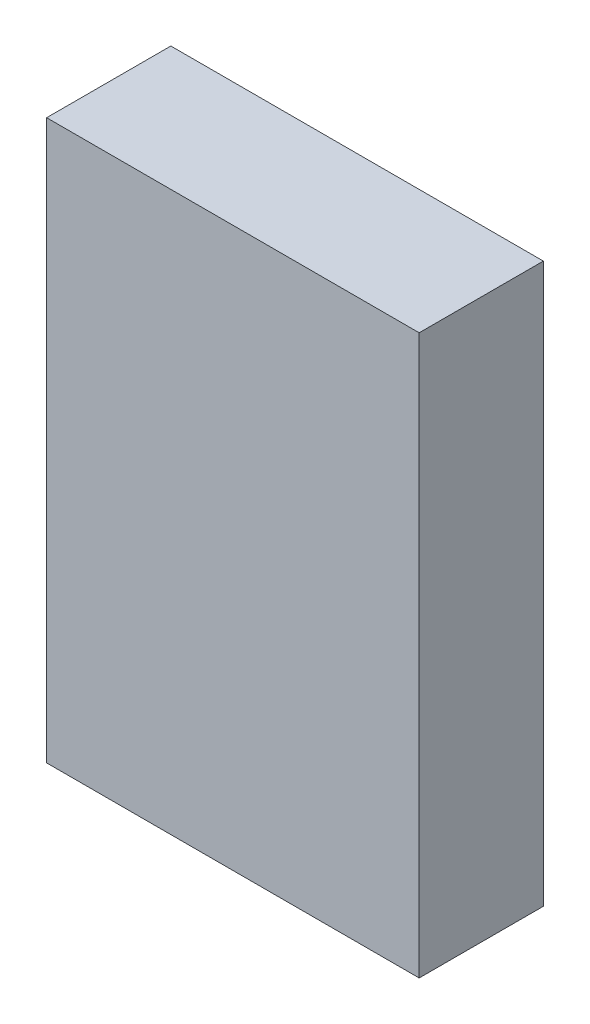
ISO-10303-21;
HEADER;
FILE_DESCRIPTION(('STEP AP214'),'2;1');
FILE_NAME('part.step','',(''),(''),'','','');
FILE_SCHEMA(('AUTOMOTIVE_DESIGN { 1 0 10303 214 1 1 1 1 }'));
ENDSEC;
DATA;
#1=APPLICATION_CONTEXT('core data for automotive mechanical design processes');
#2=APPLICATION_PROTOCOL_DEFINITION('international standard','automotive_design',2000,#1);
#3=PRODUCT_CONTEXT('',#1,'mechanical');
#4=PRODUCT('Part','Part','',(#3));
#5=PRODUCT_RELATED_PRODUCT_CATEGORY('part','',(#4));
#6=PRODUCT_DEFINITION_FORMATION('','',#4);
#7=PRODUCT_DEFINITION_CONTEXT('part definition',#1,'design');
#8=PRODUCT_DEFINITION('design','',#6,#7);
#9=PRODUCT_DEFINITION_SHAPE('','',#8);
#10=(LENGTH_UNIT() NAMED_UNIT(*) SI_UNIT(.MILLI.,.METRE.));
#11=(NAMED_UNIT(*) PLANE_ANGLE_UNIT() SI_UNIT($,.RADIAN.));
#12=(NAMED_UNIT(*) SI_UNIT($,.STERADIAN.) SOLID_ANGLE_UNIT());
#13=UNCERTAINTY_MEASURE_WITH_UNIT(LENGTH_MEASURE(1.E-05),#10,'distance_accuracy_value','');
#14=(GEOMETRIC_REPRESENTATION_CONTEXT(3) GLOBAL_UNCERTAINTY_ASSIGNED_CONTEXT((#13)) GLOBAL_UNIT_ASSIGNED_CONTEXT((#10,
#11,#12)) REPRESENTATION_CONTEXT('',''));
#15=CARTESIAN_POINT('',(0.,0.,0.));
#16=DIRECTION('',(0.,0.,1.));
#17=DIRECTION('',(1.,0.,0.));
#18=AXIS2_PLACEMENT_3D('',#15,#16,#17);
#19=CARTESIAN_POINT('',(0.,0.,20.));
#20=DIRECTION('',(1.,0.,0.));
#21=DIRECTION('',(0.,0.,-1.));
#22=AXIS2_PLACEMENT_3D('',#19,#20,#21);
#23=PLANE('',#22);
#24=DIRECTION('',(0.,-1.,0.));
#25=VECTOR('',#24,1.);
#26=CARTESIAN_POINT('',(0.,0.,0.));
#27=LINE('',#26,#25);
#28=CARTESIAN_POINT('',(0.,90.,0.));
#29=VERTEX_POINT('',#28);
#30=CARTESIAN_POINT('',(0.,0.,0.));
#31=VERTEX_POINT('',#30);
#32=EDGE_CURVE('E96',#29,#31,#27,.T.);
#33=ORIENTED_EDGE('',*,*,#32,.T.);
#34=DIRECTION('',(0.,0.,-1.));
#35=VECTOR('',#34,1.);
#36=CARTESIAN_POINT('',(0.,0.,20.));
#37=LINE('',#36,#35);
#38=CARTESIAN_POINT('',(0.,0.,20.));
#39=VERTEX_POINT('',#38);
#40=EDGE_CURVE('E11',#39,#31,#37,.T.);
#41=ORIENTED_EDGE('',*,*,#40,.F.);
#42=DIRECTION('',(0.,-1.,0.));
#43=VECTOR('',#42,1.);
#44=CARTESIAN_POINT('',(0.,0.,20.));
#45=LINE('',#44,#43);
#46=CARTESIAN_POINT('',(0.,90.,20.));
#47=VERTEX_POINT('',#46);
#48=EDGE_CURVE('E84',#47,#39,#45,.T.);
#49=ORIENTED_EDGE('',*,*,#48,.F.);
#50=DIRECTION('',(0.,0.,-1.));
#51=VECTOR('',#50,1.);
#52=CARTESIAN_POINT('',(0.,90.,20.));
#53=LINE('',#52,#51);
#54=EDGE_CURVE('E92',#47,#29,#53,.T.);
#55=ORIENTED_EDGE('',*,*,#54,.T.);
#56=EDGE_LOOP('',(#33,#41,#49,#55));
#57=FACE_BOUND('',#56,.T.);
#58=ADVANCED_FACE('F33',(#57),#23,.F.);
#59=CARTESIAN_POINT('',(0.,0.,20.));
#60=DIRECTION('',(0.,1.,0.));
#61=DIRECTION('',(0.,0.,1.));
#62=AXIS2_PLACEMENT_3D('',#59,#60,#61);
#63=PLANE('',#62);
#64=DIRECTION('',(1.,0.,0.));
#65=VECTOR('',#64,1.);
#66=CARTESIAN_POINT('',(0.,0.,0.));
#67=LINE('',#66,#65);
#68=CARTESIAN_POINT('',(60.,0.,0.));
#69=VERTEX_POINT('',#68);
#70=EDGE_CURVE('E88',#31,#69,#67,.T.);
#71=ORIENTED_EDGE('',*,*,#70,.T.);
#72=DIRECTION('',(0.,0.,-1.));
#73=VECTOR('',#72,1.);
#74=CARTESIAN_POINT('',(60.,0.,20.));
#75=LINE('',#74,#73);
#76=CARTESIAN_POINT('',(60.,0.,20.));
#77=VERTEX_POINT('',#76);
#78=EDGE_CURVE('E41',#77,#69,#75,.T.);
#79=ORIENTED_EDGE('',*,*,#78,.F.);
#80=DIRECTION('',(1.,0.,0.));
#81=VECTOR('',#80,1.);
#82=CARTESIAN_POINT('',(0.,0.,20.));
#83=LINE('',#82,#81);
#84=EDGE_CURVE('E79',#39,#77,#83,.T.);
#85=ORIENTED_EDGE('',*,*,#84,.F.);
#86=ORIENTED_EDGE('',*,*,#40,.T.);
#87=EDGE_LOOP('',(#71,#79,#85,#86));
#88=FACE_BOUND('',#87,.T.);
#89=ADVANCED_FACE('F87',(#88),#63,.F.);
#90=CARTESIAN_POINT('',(60.,0.,20.));
#91=DIRECTION('',(-1.,0.,0.));
#92=DIRECTION('',(0.,0.,1.));
#93=AXIS2_PLACEMENT_3D('',#90,#91,#92);
#94=PLANE('',#93);
#95=DIRECTION('',(0.,1.,0.));
#96=VECTOR('',#95,1.);
#97=CARTESIAN_POINT('',(60.,0.,0.));
#98=LINE('',#97,#96);
#99=CARTESIAN_POINT('',(60.,90.,0.));
#100=VERTEX_POINT('',#99);
#101=EDGE_CURVE('E66',#69,#100,#98,.T.);
#102=ORIENTED_EDGE('',*,*,#101,.T.);
#103=DIRECTION('',(0.,0.,-1.));
#104=VECTOR('',#103,1.);
#105=CARTESIAN_POINT('',(60.,90.,20.));
#106=LINE('',#105,#104);
#107=CARTESIAN_POINT('',(60.,90.,20.));
#108=VERTEX_POINT('',#107);
#109=EDGE_CURVE('E89',#108,#100,#106,.T.);
#110=ORIENTED_EDGE('',*,*,#109,.F.);
#111=DIRECTION('',(0.,1.,0.));
#112=VECTOR('',#111,1.);
#113=CARTESIAN_POINT('',(60.,0.,20.));
#114=LINE('',#113,#112);
#115=EDGE_CURVE('E82',#77,#108,#114,.T.);
#116=ORIENTED_EDGE('',*,*,#115,.F.);
#117=ORIENTED_EDGE('',*,*,#78,.T.);
#118=EDGE_LOOP('',(#102,#110,#116,#117));
#119=FACE_BOUND('',#118,.T.);
#120=ADVANCED_FACE('F90',(#119),#94,.F.);
#121=CARTESIAN_POINT('',(0.,90.,20.));
#122=DIRECTION('',(0.,-1.,0.));
#123=DIRECTION('',(0.,0.,-1.));
#124=AXIS2_PLACEMENT_3D('',#121,#122,#123);
#125=PLANE('',#124);
#126=DIRECTION('',(-1.,0.,0.));
#127=VECTOR('',#126,1.);
#128=CARTESIAN_POINT('',(0.,90.,0.));
#129=LINE('',#128,#127);
#130=EDGE_CURVE('E72',#100,#29,#129,.T.);
#131=ORIENTED_EDGE('',*,*,#130,.T.);
#132=ORIENTED_EDGE('',*,*,#54,.F.);
#133=DIRECTION('',(-1.,0.,0.));
#134=VECTOR('',#133,1.);
#135=CARTESIAN_POINT('',(0.,90.,20.));
#136=LINE('',#135,#134);
#137=EDGE_CURVE('E49',#108,#47,#136,.T.);
#138=ORIENTED_EDGE('',*,*,#137,.F.);
#139=ORIENTED_EDGE('',*,*,#109,.T.);
#140=EDGE_LOOP('',(#131,#132,#138,#139));
#141=FACE_BOUND('',#140,.T.);
#142=ADVANCED_FACE('F103',(#141),#125,.F.);
#143=CARTESIAN_POINT('',(0.,90.,20.));
#144=DIRECTION('',(0.,0.,-1.));
#145=DIRECTION('',(-1.,0.,0.));
#146=AXIS2_PLACEMENT_3D('',#143,#144,#145);
#147=PLANE('',#146);
#148=ORIENTED_EDGE('',*,*,#48,.T.);
#149=ORIENTED_EDGE('',*,*,#84,.T.);
#150=ORIENTED_EDGE('',*,*,#115,.T.);
#151=ORIENTED_EDGE('',*,*,#137,.T.);
#152=EDGE_LOOP('',(#148,#149,#150,#151));
#153=FACE_BOUND('',#152,.T.);
#154=ADVANCED_FACE('F80',(#153),#147,.F.);
#155=CARTESIAN_POINT('',(0.,90.,0.));
#156=DIRECTION('',(0.,0.,-1.));
#157=DIRECTION('',(-1.,0.,0.));
#158=AXIS2_PLACEMENT_3D('',#155,#156,#157);
#159=PLANE('',#158);
#160=ORIENTED_EDGE('',*,*,#32,.F.);
#161=ORIENTED_EDGE('',*,*,#130,.F.);
#162=ORIENTED_EDGE('',*,*,#101,.F.);
#163=ORIENTED_EDGE('',*,*,#70,.F.);
#164=EDGE_LOOP('',(#160,#161,#162,#163));
#165=FACE_BOUND('',#164,.T.);
#166=ADVANCED_FACE('F106',(#165),#159,.T.);
#167=CLOSED_SHELL('',(#58,#89,#120,#142,#154,#166));
#168=MANIFOLD_SOLID_BREP('B2',#167);
#169=ADVANCED_BREP_SHAPE_REPRESENTATION('',(#18,#168),#14);
#170=SHAPE_DEFINITION_REPRESENTATION(#9,#169);
ENDSEC;
END-ISO-10303-21;
